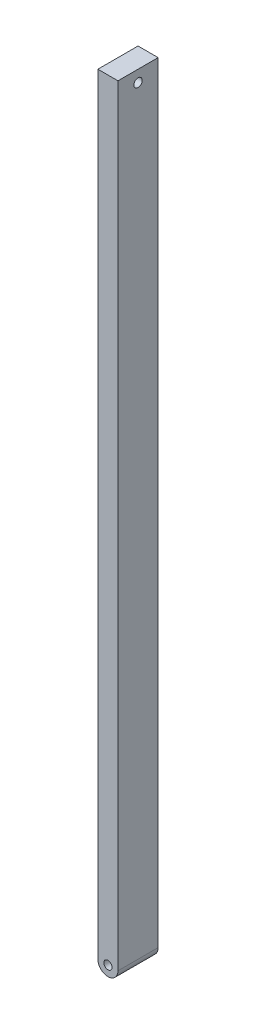
ISO-10303-21;
HEADER;
FILE_DESCRIPTION(('STEP AP214'),'2;1');
FILE_NAME('part.step','',(''),(''),'','','');
FILE_SCHEMA(('AUTOMOTIVE_DESIGN { 1 0 10303 214 1 1 1 1 }'));
ENDSEC;
DATA;
#1=APPLICATION_CONTEXT('core data for automotive mechanical design processes');
#2=APPLICATION_PROTOCOL_DEFINITION('international standard','automotive_design',2000,#1);
#3=PRODUCT_CONTEXT('',#1,'mechanical');
#4=PRODUCT('Part','Part','',(#3));
#5=PRODUCT_RELATED_PRODUCT_CATEGORY('part','',(#4));
#6=PRODUCT_DEFINITION_FORMATION('','',#4);
#7=PRODUCT_DEFINITION_CONTEXT('part definition',#1,'design');
#8=PRODUCT_DEFINITION('design','',#6,#7);
#9=PRODUCT_DEFINITION_SHAPE('','',#8);
#10=(LENGTH_UNIT() NAMED_UNIT(*) SI_UNIT(.MILLI.,.METRE.));
#11=(NAMED_UNIT(*) PLANE_ANGLE_UNIT() SI_UNIT($,.RADIAN.));
#12=(NAMED_UNIT(*) SI_UNIT($,.STERADIAN.) SOLID_ANGLE_UNIT());
#13=UNCERTAINTY_MEASURE_WITH_UNIT(LENGTH_MEASURE(1.E-05),#10,'distance_accuracy_value','');
#14=(GEOMETRIC_REPRESENTATION_CONTEXT(3) GLOBAL_UNCERTAINTY_ASSIGNED_CONTEXT((#13)) GLOBAL_UNIT_ASSIGNED_CONTEXT((#10,
#11,#12)) REPRESENTATION_CONTEXT('',''));
#15=CARTESIAN_POINT('',(0.,0.,0.));
#16=DIRECTION('',(0.,0.,1.));
#17=DIRECTION('',(1.,0.,0.));
#18=AXIS2_PLACEMENT_3D('',#15,#16,#17);
#19=CARTESIAN_POINT('',(-0.499999999999996,-40.8979953044151,2.));
#20=DIRECTION('',(0.,0.,1.));
#21=DIRECTION('',(1.,0.,0.));
#22=AXIS2_PLACEMENT_3D('',#19,#20,#21);
#23=PLANE('',#22);
#24=DIRECTION('',(0.,-1.,0.));
#25=VECTOR('',#24,1.);
#26=CARTESIAN_POINT('',(-1.,-3.1079953044151,2.));
#27=LINE('',#26,#25);
#28=CARTESIAN_POINT('',(-1.,-2.5279953044151,2.));
#29=VERTEX_POINT('',#28);
#30=CARTESIAN_POINT('',(-0.999999999999996,-40.8979953044151,2.));
#31=VERTEX_POINT('',#30);
#32=EDGE_CURVE('E77',#29,#31,#27,.T.);
#33=ORIENTED_EDGE('',*,*,#32,.T.);
#34=CARTESIAN_POINT('',(-0.499999999999996,-40.8979953044151,2.));
#35=DIRECTION('',(0.,0.,1.));
#36=DIRECTION('',(1.,0.,0.));
#37=AXIS2_PLACEMENT_3D('',#34,#35,#36);
#38=CIRCLE('',#37,0.5);
#39=CARTESIAN_POINT('',(0.,-40.8979953044151,2.));
#40=VERTEX_POINT('',#39);
#41=EDGE_CURVE('E80',#31,#40,#38,.T.);
#42=ORIENTED_EDGE('',*,*,#41,.T.);
#43=DIRECTION('',(0.,1.,0.));
#44=VECTOR('',#43,1.);
#45=CARTESIAN_POINT('',(0.,-3.1079953044151,2.));
#46=LINE('',#45,#44);
#47=CARTESIAN_POINT('',(0.,-2.5279953044151,2.));
#48=VERTEX_POINT('',#47);
#49=EDGE_CURVE('E84',#40,#48,#46,.T.);
#50=ORIENTED_EDGE('',*,*,#49,.T.);
#51=DIRECTION('',(-1.,0.,0.));
#52=VECTOR('',#51,1.);
#53=CARTESIAN_POINT('',(-1.,-2.5279953044151,2.));
#54=LINE('',#53,#52);
#55=EDGE_CURVE('E49',#48,#29,#54,.T.);
#56=ORIENTED_EDGE('',*,*,#55,.T.);
#57=EDGE_LOOP('',(#33,#42,#50,#56));
#58=FACE_BOUND('',#57,.T.);
#59=CARTESIAN_POINT('',(-0.499999999999996,-40.8979953044151,2.));
#60=DIRECTION('',(0.,0.,1.));
#61=DIRECTION('',(1.,0.,0.));
#62=AXIS2_PLACEMENT_3D('',#59,#60,#61);
#63=CIRCLE('',#62,0.20387092882995);
#64=CARTESIAN_POINT('',(-0.296129071170045,-40.8979953044151,2.));
#65=VERTEX_POINT('',#64);
#66=EDGE_CURVE('E98',#65,#65,#63,.T.);
#67=ORIENTED_EDGE('',*,*,#66,.F.);
#68=EDGE_LOOP('',(#67));
#69=FACE_BOUND('',#68,.T.);
#70=ADVANCED_FACE('F32',(#58,#69),#23,.T.);
#71=CARTESIAN_POINT('',(-0.499999999999996,-40.8979953044151,0.));
#72=DIRECTION('',(0.,0.,1.));
#73=DIRECTION('',(1.,0.,0.));
#74=AXIS2_PLACEMENT_3D('',#71,#72,#73);
#75=PLANE('',#74);
#76=DIRECTION('',(0.,-1.,0.));
#77=VECTOR('',#76,1.);
#78=CARTESIAN_POINT('',(-1.,-3.1079953044151,0.));
#79=LINE('',#78,#77);
#80=CARTESIAN_POINT('',(-1.,-2.5279953044151,0.));
#81=VERTEX_POINT('',#80);
#82=CARTESIAN_POINT('',(-0.999999999999996,-40.8979953044151,0.));
#83=VERTEX_POINT('',#82);
#84=EDGE_CURVE('E72',#81,#83,#79,.T.);
#85=ORIENTED_EDGE('',*,*,#84,.F.);
#86=DIRECTION('',(-1.,0.,0.));
#87=VECTOR('',#86,1.);
#88=CARTESIAN_POINT('',(-1.,-2.5279953044151,0.));
#89=LINE('',#88,#87);
#90=CARTESIAN_POINT('',(0.,-2.5279953044151,0.));
#91=VERTEX_POINT('',#90);
#92=EDGE_CURVE('E101',#91,#81,#89,.T.);
#93=ORIENTED_EDGE('',*,*,#92,.F.);
#94=DIRECTION('',(0.,1.,0.));
#95=VECTOR('',#94,1.);
#96=CARTESIAN_POINT('',(0.,-2.5279953044151,0.));
#97=LINE('',#96,#95);
#98=CARTESIAN_POINT('',(0.,-40.8979953044151,0.));
#99=VERTEX_POINT('',#98);
#100=EDGE_CURVE('E65',#99,#91,#97,.T.);
#101=ORIENTED_EDGE('',*,*,#100,.F.);
#102=CARTESIAN_POINT('',(-0.499999999999996,-40.8979953044151,0.));
#103=DIRECTION('',(0.,0.,1.));
#104=DIRECTION('',(1.,0.,0.));
#105=AXIS2_PLACEMENT_3D('',#102,#103,#104);
#106=CIRCLE('',#105,0.5);
#107=EDGE_CURVE('E89',#83,#99,#106,.T.);
#108=ORIENTED_EDGE('',*,*,#107,.F.);
#109=EDGE_LOOP('',(#85,#93,#101,#108));
#110=FACE_BOUND('',#109,.T.);
#111=CARTESIAN_POINT('',(-0.499999999999996,-40.8979953044151,0.));
#112=DIRECTION('',(0.,0.,1.));
#113=DIRECTION('',(1.,0.,0.));
#114=AXIS2_PLACEMENT_3D('',#111,#112,#113);
#115=CIRCLE('',#114,0.20387092882995);
#116=CARTESIAN_POINT('',(-0.296129071170045,-40.8979953044151,0.));
#117=VERTEX_POINT('',#116);
#118=EDGE_CURVE('E113',#117,#117,#115,.T.);
#119=ORIENTED_EDGE('',*,*,#118,.T.);
#120=EDGE_LOOP('',(#119));
#121=FACE_BOUND('',#120,.T.);
#122=ADVANCED_FACE('F107',(#110,#121),#75,.F.);
#123=CARTESIAN_POINT('',(-1.,-3.1079953044151,2.));
#124=DIRECTION('',(1.,0.,0.));
#125=DIRECTION('',(0.,1.,0.));
#126=AXIS2_PLACEMENT_3D('',#123,#124,#125);
#127=PLANE('',#126);
#128=CARTESIAN_POINT('',(-1.00000000000008,-3.1079953044151,1.));
#129=DIRECTION('',(1.,0.,0.));
#130=DIRECTION('',(0.,1.,0.));
#131=AXIS2_PLACEMENT_3D('',#128,#129,#130);
#132=CIRCLE('',#131,0.208826812329482);
#133=CARTESIAN_POINT('',(-1.00000000000008,-2.89916849208562,1.));
#134=VERTEX_POINT('',#133);
#135=EDGE_CURVE('E115',#134,#134,#132,.T.);
#136=ORIENTED_EDGE('',*,*,#135,.T.);
#137=EDGE_LOOP('',(#136));
#138=FACE_BOUND('',#137,.T.);
#139=ORIENTED_EDGE('',*,*,#84,.T.);
#140=DIRECTION('',(0.,0.,-1.));
#141=VECTOR('',#140,1.);
#142=CARTESIAN_POINT('',(-0.999999999999996,-40.8979953044151,2.));
#143=LINE('',#142,#141);
#144=EDGE_CURVE('E11',#31,#83,#143,.T.);
#145=ORIENTED_EDGE('',*,*,#144,.F.);
#146=ORIENTED_EDGE('',*,*,#32,.F.);
#147=DIRECTION('',(0.,0.,-1.));
#148=VECTOR('',#147,1.);
#149=CARTESIAN_POINT('',(-1.,-2.5279953044151,2.));
#150=LINE('',#149,#148);
#151=EDGE_CURVE('E93',#29,#81,#150,.T.);
#152=ORIENTED_EDGE('',*,*,#151,.T.);
#153=EDGE_LOOP('',(#139,#145,#146,#152));
#154=FACE_BOUND('',#153,.T.);
#155=ADVANCED_FACE('F34',(#138,#154),#127,.F.);
#156=CARTESIAN_POINT('',(-0.499999999999996,-40.8979953044151,2.));
#157=DIRECTION('',(0.,0.,-1.));
#158=DIRECTION('',(-1.,0.,0.));
#159=AXIS2_PLACEMENT_3D('',#156,#157,#158);
#160=CYLINDRICAL_SURFACE('',#159,0.5);
#161=ORIENTED_EDGE('',*,*,#107,.T.);
#162=DIRECTION('',(0.,0.,-1.));
#163=VECTOR('',#162,1.);
#164=CARTESIAN_POINT('',(0.,-40.8979953044151,2.));
#165=LINE('',#164,#163);
#166=EDGE_CURVE('E41',#40,#99,#165,.T.);
#167=ORIENTED_EDGE('',*,*,#166,.F.);
#168=ORIENTED_EDGE('',*,*,#41,.F.);
#169=ORIENTED_EDGE('',*,*,#144,.T.);
#170=EDGE_LOOP('',(#161,#167,#168,#169));
#171=FACE_BOUND('',#170,.T.);
#172=ADVANCED_FACE('F88',(#171),#160,.T.);
#173=CARTESIAN_POINT('',(0.,-2.5279953044151,2.));
#174=DIRECTION('',(-1.,0.,0.));
#175=DIRECTION('',(0.,-1.,0.));
#176=AXIS2_PLACEMENT_3D('',#173,#174,#175);
#177=PLANE('',#176);
#178=CARTESIAN_POINT('',(0.,-3.1079953044151,1.));
#179=DIRECTION('',(1.,0.,0.));
#180=DIRECTION('',(0.,1.,0.));
#181=AXIS2_PLACEMENT_3D('',#178,#179,#180);
#182=CIRCLE('',#181,0.208826812329482);
#183=CARTESIAN_POINT('',(0.,-2.89916849208562,1.));
#184=VERTEX_POINT('',#183);
#185=EDGE_CURVE('E120',#184,#184,#182,.T.);
#186=ORIENTED_EDGE('',*,*,#185,.F.);
#187=EDGE_LOOP('',(#186));
#188=FACE_BOUND('',#187,.T.);
#189=ORIENTED_EDGE('',*,*,#100,.T.);
#190=DIRECTION('',(0.,0.,-1.));
#191=VECTOR('',#190,1.);
#192=CARTESIAN_POINT('',(0.,-2.5279953044151,2.));
#193=LINE('',#192,#191);
#194=EDGE_CURVE('E90',#48,#91,#193,.T.);
#195=ORIENTED_EDGE('',*,*,#194,.F.);
#196=ORIENTED_EDGE('',*,*,#49,.F.);
#197=ORIENTED_EDGE('',*,*,#166,.T.);
#198=EDGE_LOOP('',(#189,#195,#196,#197));
#199=FACE_BOUND('',#198,.T.);
#200=ADVANCED_FACE('F91',(#188,#199),#177,.F.);
#201=CARTESIAN_POINT('',(-1.,-2.5279953044151,2.));
#202=DIRECTION('',(0.,-1.,0.));
#203=DIRECTION('',(0.,0.,-1.));
#204=AXIS2_PLACEMENT_3D('',#201,#202,#203);
#205=PLANE('',#204);
#206=ORIENTED_EDGE('',*,*,#92,.T.);
#207=ORIENTED_EDGE('',*,*,#151,.F.);
#208=ORIENTED_EDGE('',*,*,#55,.F.);
#209=ORIENTED_EDGE('',*,*,#194,.T.);
#210=EDGE_LOOP('',(#206,#207,#208,#209));
#211=FACE_BOUND('',#210,.T.);
#212=ADVANCED_FACE('F106',(#211),#205,.F.);
#213=CARTESIAN_POINT('',(-0.499999999999996,-40.8979953044151,2.));
#214=DIRECTION('',(0.,0.,-1.));
#215=DIRECTION('',(-1.,0.,0.));
#216=AXIS2_PLACEMENT_3D('',#213,#214,#215);
#217=CYLINDRICAL_SURFACE('',#216,0.20387092882995);
#218=ORIENTED_EDGE('',*,*,#66,.T.);
#219=EDGE_LOOP('',(#218));
#220=FACE_BOUND('',#219,.T.);
#221=ORIENTED_EDGE('',*,*,#118,.F.);
#222=EDGE_LOOP('',(#221));
#223=FACE_BOUND('',#222,.T.);
#224=ADVANCED_FACE('F134',(#220,#223),#217,.F.);
#225=CARTESIAN_POINT('',(-1.00000000000008,-3.1079953044151,1.));
#226=DIRECTION('',(1.,0.,0.));
#227=DIRECTION('',(0.,1.,0.));
#228=AXIS2_PLACEMENT_3D('',#225,#226,#227);
#229=CYLINDRICAL_SURFACE('',#228,0.208826812329482);
#230=ORIENTED_EDGE('',*,*,#135,.F.);
#231=EDGE_LOOP('',(#230));
#232=FACE_BOUND('',#231,.T.);
#233=ORIENTED_EDGE('',*,*,#185,.T.);
#234=EDGE_LOOP('',(#233));
#235=FACE_BOUND('',#234,.T.);
#236=ADVANCED_FACE('F126',(#232,#235),#229,.F.);
#237=CLOSED_SHELL('',(#70,#122,#155,#172,#200,#212,#224,#236));
#238=MANIFOLD_SOLID_BREP('B2',#237);
#239=ADVANCED_BREP_SHAPE_REPRESENTATION('',(#18,#238),#14);
#240=SHAPE_DEFINITION_REPRESENTATION(#9,#239);
ENDSEC;
END-ISO-10303-21;
